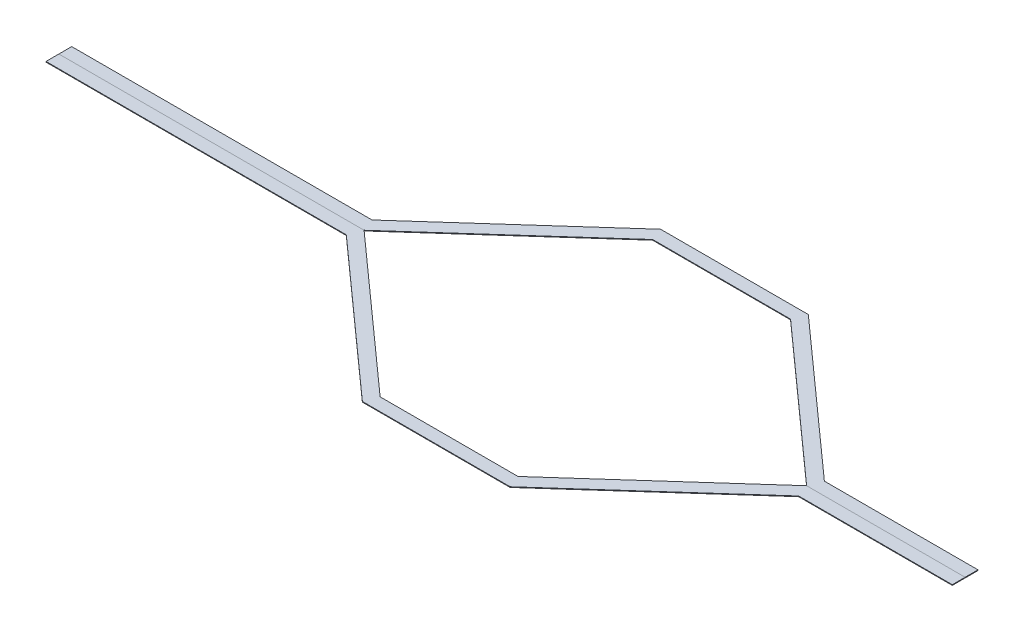
ISO-10303-21;
HEADER;
FILE_DESCRIPTION(('STEP AP214'),'2;1');
FILE_NAME('part.step','',(''),(''),'','','');
FILE_SCHEMA(('AUTOMOTIVE_DESIGN { 1 0 10303 214 1 1 1 1 }'));
ENDSEC;
DATA;
#1=APPLICATION_CONTEXT('core data for automotive mechanical design processes');
#2=APPLICATION_PROTOCOL_DEFINITION('international standard','automotive_design',2000,#1);
#3=PRODUCT_CONTEXT('',#1,'mechanical');
#4=PRODUCT('Part','Part','',(#3));
#5=PRODUCT_RELATED_PRODUCT_CATEGORY('part','',(#4));
#6=PRODUCT_DEFINITION_FORMATION('','',#4);
#7=PRODUCT_DEFINITION_CONTEXT('part definition',#1,'design');
#8=PRODUCT_DEFINITION('design','',#6,#7);
#9=PRODUCT_DEFINITION_SHAPE('','',#8);
#10=(LENGTH_UNIT() NAMED_UNIT(*) SI_UNIT(.MILLI.,.METRE.));
#11=(NAMED_UNIT(*) PLANE_ANGLE_UNIT() SI_UNIT($,.RADIAN.));
#12=(NAMED_UNIT(*) SI_UNIT($,.STERADIAN.) SOLID_ANGLE_UNIT());
#13=UNCERTAINTY_MEASURE_WITH_UNIT(LENGTH_MEASURE(1.E-05),#10,'distance_accuracy_value','');
#14=(GEOMETRIC_REPRESENTATION_CONTEXT(3) GLOBAL_UNCERTAINTY_ASSIGNED_CONTEXT((#13)) GLOBAL_UNIT_ASSIGNED_CONTEXT((#10,
#11,#12)) REPRESENTATION_CONTEXT('',''));
#15=CARTESIAN_POINT('',(0.,0.,0.));
#16=DIRECTION('',(0.,0.,1.));
#17=DIRECTION('',(1.,0.,0.));
#18=AXIS2_PLACEMENT_3D('',#15,#16,#17);
#19=CARTESIAN_POINT('',(0.,2.54,0.));
#20=DIRECTION('',(0.,1.,0.));
#21=DIRECTION('',(0.,0.,1.));
#22=AXIS2_PLACEMENT_3D('',#19,#20,#21);
#23=PLANE('',#22);
#24=DIRECTION('',(-1.,0.,0.));
#25=VECTOR('',#24,1.);
#26=CARTESIAN_POINT('',(0.,2.54,0.));
#27=LINE('',#26,#25);
#28=CARTESIAN_POINT('',(1748.8414211344,2.54,0.));
#29=VERTEX_POINT('',#28);
#30=CARTESIAN_POINT('',(2375.3067105672,2.54,0.));
#31=VERTEX_POINT('',#30);
#32=EDGE_CURVE('P0_E161',#29,#31,#27,.F.);
#33=ORIENTED_EDGE('',*,*,#32,.T.);
#34=DIRECTION('',(0.,0.,-1.));
#35=VECTOR('',#34,1.);
#36=CARTESIAN_POINT('',(2375.3067105672,2.54,0.));
#37=LINE('',#36,#35);
#38=CARTESIAN_POINT('',(2375.3067105672,2.54,-50.8));
#39=VERTEX_POINT('',#38);
#40=EDGE_CURVE('P0_E163',#39,#31,#37,.F.);
#41=ORIENTED_EDGE('',*,*,#40,.F.);
#42=DIRECTION('',(-1.,0.,0.));
#43=VECTOR('',#42,1.);
#44=CARTESIAN_POINT('',(0.,2.54,-50.8));
#45=LINE('',#44,#43);
#46=CARTESIAN_POINT('',(1768.2467105672,2.54,-50.8000000000003));
#47=VERTEX_POINT('',#46);
#48=EDGE_CURVE('P0_E118',#47,#39,#45,.F.);
#49=ORIENTED_EDGE('',*,*,#48,.F.);
#50=DIRECTION('',(-0.745323557128352,0.,-0.666702928739285));
#51=VECTOR('',#50,1.);
#52=CARTESIAN_POINT('',(811.215920403235,2.54,-906.878175167768));
#53=LINE('',#52,#51);
#54=CARTESIAN_POINT('',(1166.2667105672,2.54,-589.28));
#55=VERTEX_POINT('',#54);
#56=EDGE_CURVE('P0_E19',#55,#47,#53,.F.);
#57=ORIENTED_EDGE('',*,*,#56,.F.);
#58=DIRECTION('',(-1.,0.,0.));
#59=VECTOR('',#58,1.);
#60=CARTESIAN_POINT('',(0.,2.54,-589.28));
#61=LINE('',#60,#59);
#62=CARTESIAN_POINT('',(582.574710567202,2.54,-589.28));
#63=VERTEX_POINT('',#62);
#64=EDGE_CURVE('P0_E106',#63,#55,#61,.F.);
#65=ORIENTED_EDGE('',*,*,#64,.F.);
#66=DIRECTION('',(-0.745323557128352,0.,0.666702928739285));
#67=VECTOR('',#66,1.);
#68=CARTESIAN_POINT('',(-33.8685087799557,2.54,-37.8624367021203));
#69=LINE('',#68,#67);
#70=CARTESIAN_POINT('',(-19.4052894327977,2.54,-50.8));
#71=VERTEX_POINT('',#70);
#72=EDGE_CURVE('P0_E101',#71,#63,#69,.F.);
#73=ORIENTED_EDGE('',*,*,#72,.F.);
#74=DIRECTION('',(-1.,0.,0.));
#75=VECTOR('',#74,1.);
#76=CARTESIAN_POINT('',(0.,2.54,-50.8));
#77=LINE('',#76,#75);
#78=CARTESIAN_POINT('',(-1206.0932894328,2.54,-50.8));
#79=VERTEX_POINT('',#78);
#80=EDGE_CURVE('P0_E129',#79,#71,#77,.F.);
#81=ORIENTED_EDGE('',*,*,#80,.F.);
#82=DIRECTION('',(0.,0.,-1.));
#83=VECTOR('',#82,1.);
#84=CARTESIAN_POINT('',(-1206.0932894328,2.54,0.));
#85=LINE('',#84,#83);
#86=CARTESIAN_POINT('',(-1206.0932894328,2.54,0.));
#87=VERTEX_POINT('',#86);
#88=EDGE_CURVE('P0_E136',#79,#87,#85,.F.);
#89=ORIENTED_EDGE('',*,*,#88,.T.);
#90=DIRECTION('',(-1.,0.,0.));
#91=VECTOR('',#90,1.);
#92=CARTESIAN_POINT('',(0.,2.54,0.));
#93=LINE('',#92,#91);
#94=CARTESIAN_POINT('',(0.,2.54,0.));
#95=VERTEX_POINT('',#94);
#96=EDGE_CURVE('P0_E141',#87,#95,#93,.F.);
#97=ORIENTED_EDGE('',*,*,#96,.T.);
#98=DIRECTION('',(-0.745323557128352,0.,0.666702928739285));
#99=VECTOR('',#98,1.);
#100=CARTESIAN_POINT('',(0.,2.54,0.));
#101=LINE('',#100,#99);
#102=CARTESIAN_POINT('',(601.98,2.54,-538.48));
#103=VERTEX_POINT('',#102);
#104=EDGE_CURVE('P0_E146',#95,#103,#101,.F.);
#105=ORIENTED_EDGE('',*,*,#104,.T.);
#106=DIRECTION('',(-1.,0.,0.));
#107=VECTOR('',#106,1.);
#108=CARTESIAN_POINT('',(0.,2.54,-538.48));
#109=LINE('',#108,#107);
#110=CARTESIAN_POINT('',(1146.8614211344,2.54,-538.48));
#111=VERTEX_POINT('',#110);
#112=EDGE_CURVE('P0_E151',#103,#111,#109,.F.);
#113=ORIENTED_EDGE('',*,*,#112,.T.);
#114=DIRECTION('',(-0.745323557128352,0.,-0.666702928739285));
#115=VECTOR('',#114,1.);
#116=CARTESIAN_POINT('',(777.34741162328,2.54,-869.015738465647));
#117=LINE('',#116,#115);
#118=EDGE_CURVE('P0_E156',#111,#29,#117,.F.);
#119=ORIENTED_EDGE('',*,*,#118,.T.);
#120=EDGE_LOOP('',(#33,#41,#49,#57,#65,#73,#81,#89,#97,#105,#113,#119));
#121=FACE_BOUND('',#120,.T.);
#122=ADVANCED_FACE('P0_F16',(#121),#23,.T.);
#123=CARTESIAN_POINT('',(811.215920403235,2.54,-906.878175167768));
#124=DIRECTION('',(0.666702928739285,0.,-0.745323557128352));
#125=DIRECTION('',(-0.745323557128352,0.,-0.666702928739285));
#126=AXIS2_PLACEMENT_3D('',#123,#124,#125);
#127=PLANE('',#126);
#128=ORIENTED_EDGE('',*,*,#56,.T.);
#129=DIRECTION('',(0.,1.,0.));
#130=VECTOR('',#129,1.);
#131=CARTESIAN_POINT('',(1768.2467105672,2.54,-50.8));
#132=LINE('',#131,#130);
#133=CARTESIAN_POINT('',(1768.2467105672,0.,-50.8000000000003));
#134=VERTEX_POINT('',#133);
#135=EDGE_CURVE('P0_E167',#134,#47,#132,.T.);
#136=ORIENTED_EDGE('',*,*,#135,.F.);
#137=DIRECTION('',(-0.745323557128352,0.,-0.666702928739285));
#138=VECTOR('',#137,1.);
#139=CARTESIAN_POINT('',(1768.2467105672,0.,-50.8000000000004));
#140=LINE('',#139,#138);
#141=CARTESIAN_POINT('',(1166.2667105672,0.,-589.28));
#142=VERTEX_POINT('',#141);
#143=EDGE_CURVE('P0_E124',#134,#142,#140,.T.);
#144=ORIENTED_EDGE('',*,*,#143,.T.);
#145=DIRECTION('',(0.,1.,0.));
#146=VECTOR('',#145,1.);
#147=CARTESIAN_POINT('',(1166.2667105672,2.54,-589.28));
#148=LINE('',#147,#146);
#149=EDGE_CURVE('P0_E111',#55,#142,#148,.F.);
#150=ORIENTED_EDGE('',*,*,#149,.F.);
#151=EDGE_LOOP('',(#128,#136,#144,#150));
#152=FACE_BOUND('',#151,.T.);
#153=ADVANCED_FACE('P0_F123',(#152),#127,.T.);
#154=CARTESIAN_POINT('',(0.,2.54,-589.28));
#155=DIRECTION('',(0.,0.,-1.));
#156=DIRECTION('',(-1.,0.,0.));
#157=AXIS2_PLACEMENT_3D('',#154,#155,#156);
#158=PLANE('',#157);
#159=ORIENTED_EDGE('',*,*,#64,.T.);
#160=ORIENTED_EDGE('',*,*,#149,.T.);
#161=DIRECTION('',(1.,0.,0.));
#162=VECTOR('',#161,1.);
#163=CARTESIAN_POINT('',(0.,0.,-589.28));
#164=LINE('',#163,#162);
#165=CARTESIAN_POINT('',(582.574710567202,0.,-589.28));
#166=VERTEX_POINT('',#165);
#167=EDGE_CURVE('P0_E172',#142,#166,#164,.F.);
#168=ORIENTED_EDGE('',*,*,#167,.T.);
#169=DIRECTION('',(0.,1.,0.));
#170=VECTOR('',#169,1.);
#171=CARTESIAN_POINT('',(582.574710567202,2.54,-589.28));
#172=LINE('',#171,#170);
#173=EDGE_CURVE('P0_E113',#63,#166,#172,.F.);
#174=ORIENTED_EDGE('',*,*,#173,.F.);
#175=EDGE_LOOP('',(#159,#160,#168,#174));
#176=FACE_BOUND('',#175,.T.);
#177=ADVANCED_FACE('P0_F108',(#176),#158,.T.);
#178=CARTESIAN_POINT('',(-33.8685087799557,2.54,-37.8624367021203));
#179=DIRECTION('',(-0.666702928739285,0.,-0.745323557128352));
#180=DIRECTION('',(-0.745323557128352,0.,0.666702928739285));
#181=AXIS2_PLACEMENT_3D('',#178,#179,#180);
#182=PLANE('',#181);
#183=ORIENTED_EDGE('',*,*,#72,.T.);
#184=ORIENTED_EDGE('',*,*,#173,.T.);
#185=DIRECTION('',(-0.745323557128352,0.,0.666702928739285));
#186=VECTOR('',#185,1.);
#187=CARTESIAN_POINT('',(582.574710567202,0.,-589.28));
#188=LINE('',#187,#186);
#189=CARTESIAN_POINT('',(-19.4052894327978,0.,-50.8));
#190=VERTEX_POINT('',#189);
#191=EDGE_CURVE('P0_E174',#166,#190,#188,.T.);
#192=ORIENTED_EDGE('',*,*,#191,.T.);
#193=DIRECTION('',(0.,1.,0.));
#194=VECTOR('',#193,1.);
#195=CARTESIAN_POINT('',(-19.4052894327978,2.54,-50.8));
#196=LINE('',#195,#194);
#197=EDGE_CURVE('P0_E131',#71,#190,#196,.F.);
#198=ORIENTED_EDGE('',*,*,#197,.F.);
#199=EDGE_LOOP('',(#183,#184,#192,#198));
#200=FACE_BOUND('',#199,.T.);
#201=ADVANCED_FACE('P0_F233',(#200),#182,.T.);
#202=CARTESIAN_POINT('',(0.,2.54,-50.8));
#203=DIRECTION('',(0.,0.,-1.));
#204=DIRECTION('',(-1.,0.,0.));
#205=AXIS2_PLACEMENT_3D('',#202,#203,#204);
#206=PLANE('',#205);
#207=ORIENTED_EDGE('',*,*,#80,.T.);
#208=ORIENTED_EDGE('',*,*,#197,.T.);
#209=DIRECTION('',(1.,0.,0.));
#210=VECTOR('',#209,1.);
#211=CARTESIAN_POINT('',(0.,0.,-50.8));
#212=LINE('',#211,#210);
#213=CARTESIAN_POINT('',(-1206.0932894328,0.,-50.8));
#214=VERTEX_POINT('',#213);
#215=EDGE_CURVE('P0_E177',#190,#214,#212,.F.);
#216=ORIENTED_EDGE('',*,*,#215,.T.);
#217=DIRECTION('',(0.,1.,0.));
#218=VECTOR('',#217,1.);
#219=CARTESIAN_POINT('',(-1206.0932894328,2.54,-50.8));
#220=LINE('',#219,#218);
#221=EDGE_CURVE('P0_E133',#214,#79,#220,.T.);
#222=ORIENTED_EDGE('',*,*,#221,.T.);
#223=EDGE_LOOP('',(#207,#208,#216,#222));
#224=FACE_BOUND('',#223,.T.);
#225=ADVANCED_FACE('P0_F232',(#224),#206,.T.);
#226=CARTESIAN_POINT('',(-1206.0932894328,2.54,0.));
#227=DIRECTION('',(1.,0.,0.));
#228=DIRECTION('',(0.,0.,-1.));
#229=AXIS2_PLACEMENT_3D('',#226,#227,#228);
#230=PLANE('',#229);
#231=DIRECTION('',(0.,1.,0.));
#232=VECTOR('',#231,1.);
#233=CARTESIAN_POINT('',(-1206.0932894328,2.54,0.));
#234=LINE('',#233,#232);
#235=CARTESIAN_POINT('',(-1206.0932894328,0.,0.));
#236=VERTEX_POINT('',#235);
#237=EDGE_CURVE('P0_E138',#236,#87,#234,.T.);
#238=ORIENTED_EDGE('',*,*,#237,.T.);
#239=ORIENTED_EDGE('',*,*,#88,.F.);
#240=ORIENTED_EDGE('',*,*,#221,.F.);
#241=DIRECTION('',(0.,0.,1.));
#242=VECTOR('',#241,1.);
#243=CARTESIAN_POINT('',(-1206.0932894328,0.,0.));
#244=LINE('',#243,#242);
#245=EDGE_CURVE('P0_E180',#214,#236,#244,.T.);
#246=ORIENTED_EDGE('',*,*,#245,.T.);
#247=EDGE_LOOP('',(#238,#239,#240,#246));
#248=FACE_BOUND('',#247,.T.);
#249=ADVANCED_FACE('P0_F228',(#248),#230,.F.);
#250=CARTESIAN_POINT('',(0.,2.54,0.));
#251=DIRECTION('',(0.,0.,-1.));
#252=DIRECTION('',(-1.,0.,0.));
#253=AXIS2_PLACEMENT_3D('',#250,#251,#252);
#254=PLANE('',#253);
#255=DIRECTION('',(0.,1.,0.));
#256=VECTOR('',#255,1.);
#257=CARTESIAN_POINT('',(0.,2.54,0.));
#258=LINE('',#257,#256);
#259=CARTESIAN_POINT('',(0.,0.,0.));
#260=VERTEX_POINT('',#259);
#261=EDGE_CURVE('P0_E143',#260,#95,#258,.T.);
#262=ORIENTED_EDGE('',*,*,#261,.T.);
#263=ORIENTED_EDGE('',*,*,#96,.F.);
#264=ORIENTED_EDGE('',*,*,#237,.F.);
#265=DIRECTION('',(1.,0.,0.));
#266=VECTOR('',#265,1.);
#267=CARTESIAN_POINT('',(0.,0.,0.));
#268=LINE('',#267,#266);
#269=EDGE_CURVE('P0_E183',#236,#260,#268,.T.);
#270=ORIENTED_EDGE('',*,*,#269,.T.);
#271=EDGE_LOOP('',(#262,#263,#264,#270));
#272=FACE_BOUND('',#271,.T.);
#273=ADVANCED_FACE('P0_F224',(#272),#254,.F.);
#274=CARTESIAN_POINT('',(0.,2.54,0.));
#275=DIRECTION('',(-0.666702928739285,0.,-0.745323557128352));
#276=DIRECTION('',(-0.745323557128352,0.,0.666702928739285));
#277=AXIS2_PLACEMENT_3D('',#274,#275,#276);
#278=PLANE('',#277);
#279=DIRECTION('',(0.,1.,0.));
#280=VECTOR('',#279,1.);
#281=CARTESIAN_POINT('',(601.98,2.54,-538.48));
#282=LINE('',#281,#280);
#283=CARTESIAN_POINT('',(601.98,0.,-538.48));
#284=VERTEX_POINT('',#283);
#285=EDGE_CURVE('P0_E148',#284,#103,#282,.T.);
#286=ORIENTED_EDGE('',*,*,#285,.T.);
#287=ORIENTED_EDGE('',*,*,#104,.F.);
#288=ORIENTED_EDGE('',*,*,#261,.F.);
#289=DIRECTION('',(0.745323557128352,0.,-0.666702928739285));
#290=VECTOR('',#289,1.);
#291=CARTESIAN_POINT('',(0.,0.,0.));
#292=LINE('',#291,#290);
#293=EDGE_CURVE('P0_E186',#260,#284,#292,.T.);
#294=ORIENTED_EDGE('',*,*,#293,.T.);
#295=EDGE_LOOP('',(#286,#287,#288,#294));
#296=FACE_BOUND('',#295,.T.);
#297=ADVANCED_FACE('P0_F220',(#296),#278,.F.);
#298=CARTESIAN_POINT('',(0.,2.54,-538.48));
#299=DIRECTION('',(0.,0.,-1.));
#300=DIRECTION('',(-1.,0.,0.));
#301=AXIS2_PLACEMENT_3D('',#298,#299,#300);
#302=PLANE('',#301);
#303=DIRECTION('',(0.,1.,0.));
#304=VECTOR('',#303,1.);
#305=CARTESIAN_POINT('',(1146.8614211344,2.54,-538.48));
#306=LINE('',#305,#304);
#307=CARTESIAN_POINT('',(1146.8614211344,0.,-538.48));
#308=VERTEX_POINT('',#307);
#309=EDGE_CURVE('P0_E153',#308,#111,#306,.T.);
#310=ORIENTED_EDGE('',*,*,#309,.T.);
#311=ORIENTED_EDGE('',*,*,#112,.F.);
#312=ORIENTED_EDGE('',*,*,#285,.F.);
#313=DIRECTION('',(1.,0.,0.));
#314=VECTOR('',#313,1.);
#315=CARTESIAN_POINT('',(0.,0.,-538.48));
#316=LINE('',#315,#314);
#317=EDGE_CURVE('P0_E189',#284,#308,#316,.T.);
#318=ORIENTED_EDGE('',*,*,#317,.T.);
#319=EDGE_LOOP('',(#310,#311,#312,#318));
#320=FACE_BOUND('',#319,.T.);
#321=ADVANCED_FACE('P0_F216',(#320),#302,.F.);
#322=CARTESIAN_POINT('',(777.34741162328,2.54,-869.015738465647));
#323=DIRECTION('',(0.666702928739285,0.,-0.745323557128352));
#324=DIRECTION('',(-0.745323557128352,0.,-0.666702928739285));
#325=AXIS2_PLACEMENT_3D('',#322,#323,#324);
#326=PLANE('',#325);
#327=DIRECTION('',(0.,1.,0.));
#328=VECTOR('',#327,1.);
#329=CARTESIAN_POINT('',(1748.8414211344,2.54,0.));
#330=LINE('',#329,#328);
#331=CARTESIAN_POINT('',(1748.8414211344,0.,1.94289029309402E-13));
#332=VERTEX_POINT('',#331);
#333=EDGE_CURVE('P0_E158',#332,#29,#330,.T.);
#334=ORIENTED_EDGE('',*,*,#333,.T.);
#335=ORIENTED_EDGE('',*,*,#118,.F.);
#336=ORIENTED_EDGE('',*,*,#309,.F.);
#337=DIRECTION('',(0.745323557128352,0.,0.666702928739285));
#338=VECTOR('',#337,1.);
#339=CARTESIAN_POINT('',(1146.8614211344,0.,-538.48));
#340=LINE('',#339,#338);
#341=EDGE_CURVE('P0_E192',#308,#332,#340,.T.);
#342=ORIENTED_EDGE('',*,*,#341,.T.);
#343=EDGE_LOOP('',(#334,#335,#336,#342));
#344=FACE_BOUND('',#343,.T.);
#345=ADVANCED_FACE('P0_F212',(#344),#326,.F.);
#346=CARTESIAN_POINT('',(0.,2.54,0.));
#347=DIRECTION('',(0.,0.,-1.));
#348=DIRECTION('',(-1.,0.,0.));
#349=AXIS2_PLACEMENT_3D('',#346,#347,#348);
#350=PLANE('',#349);
#351=DIRECTION('',(0.,1.,0.));
#352=VECTOR('',#351,1.);
#353=CARTESIAN_POINT('',(2375.3067105672,2.54,0.));
#354=LINE('',#353,#352);
#355=CARTESIAN_POINT('',(2375.3067105672,0.,0.));
#356=VERTEX_POINT('',#355);
#357=EDGE_CURVE('P0_E165',#31,#356,#354,.F.);
#358=ORIENTED_EDGE('',*,*,#357,.F.);
#359=ORIENTED_EDGE('',*,*,#32,.F.);
#360=ORIENTED_EDGE('',*,*,#333,.F.);
#361=DIRECTION('',(1.,0.,0.));
#362=VECTOR('',#361,1.);
#363=CARTESIAN_POINT('',(0.,0.,0.));
#364=LINE('',#363,#362);
#365=EDGE_CURVE('P0_E195',#332,#356,#364,.T.);
#366=ORIENTED_EDGE('',*,*,#365,.T.);
#367=EDGE_LOOP('',(#358,#359,#360,#366));
#368=FACE_BOUND('',#367,.T.);
#369=ADVANCED_FACE('P0_F208',(#368),#350,.F.);
#370=CARTESIAN_POINT('',(2375.3067105672,2.54,0.));
#371=DIRECTION('',(1.,0.,0.));
#372=DIRECTION('',(0.,0.,-1.));
#373=AXIS2_PLACEMENT_3D('',#370,#371,#372);
#374=PLANE('',#373);
#375=ORIENTED_EDGE('',*,*,#40,.T.);
#376=ORIENTED_EDGE('',*,*,#357,.T.);
#377=DIRECTION('',(0.,0.,1.));
#378=VECTOR('',#377,1.);
#379=CARTESIAN_POINT('',(2375.3067105672,0.,0.));
#380=LINE('',#379,#378);
#381=CARTESIAN_POINT('',(2375.3067105672,0.,-50.8));
#382=VERTEX_POINT('',#381);
#383=EDGE_CURVE('P0_E25',#356,#382,#380,.F.);
#384=ORIENTED_EDGE('',*,*,#383,.T.);
#385=DIRECTION('',(0.,1.,0.));
#386=VECTOR('',#385,1.);
#387=CARTESIAN_POINT('',(2375.3067105672,2.54,-50.8));
#388=LINE('',#387,#386);
#389=EDGE_CURVE('P0_E33',#39,#382,#388,.F.);
#390=ORIENTED_EDGE('',*,*,#389,.F.);
#391=EDGE_LOOP('',(#375,#376,#384,#390));
#392=FACE_BOUND('',#391,.T.);
#393=ADVANCED_FACE('P0_F201',(#392),#374,.T.);
#394=CARTESIAN_POINT('',(0.,2.54,-50.8));
#395=DIRECTION('',(0.,0.,-1.));
#396=DIRECTION('',(-1.,0.,0.));
#397=AXIS2_PLACEMENT_3D('',#394,#395,#396);
#398=PLANE('',#397);
#399=ORIENTED_EDGE('',*,*,#48,.T.);
#400=ORIENTED_EDGE('',*,*,#389,.T.);
#401=DIRECTION('',(1.,0.,0.));
#402=VECTOR('',#401,1.);
#403=CARTESIAN_POINT('',(0.,0.,-50.8));
#404=LINE('',#403,#402);
#405=EDGE_CURVE('P0_E11',#382,#134,#404,.F.);
#406=ORIENTED_EDGE('',*,*,#405,.T.);
#407=ORIENTED_EDGE('',*,*,#135,.T.);
#408=EDGE_LOOP('',(#399,#400,#406,#407));
#409=FACE_BOUND('',#408,.T.);
#410=ADVANCED_FACE('P0_F234',(#409),#398,.T.);
#411=CARTESIAN_POINT('',(0.,0.,0.));
#412=DIRECTION('',(0.,1.,0.));
#413=DIRECTION('',(0.,0.,1.));
#414=AXIS2_PLACEMENT_3D('',#411,#412,#413);
#415=PLANE('',#414);
#416=ORIENTED_EDGE('',*,*,#383,.F.);
#417=ORIENTED_EDGE('',*,*,#365,.F.);
#418=ORIENTED_EDGE('',*,*,#341,.F.);
#419=ORIENTED_EDGE('',*,*,#317,.F.);
#420=ORIENTED_EDGE('',*,*,#293,.F.);
#421=ORIENTED_EDGE('',*,*,#269,.F.);
#422=ORIENTED_EDGE('',*,*,#245,.F.);
#423=ORIENTED_EDGE('',*,*,#215,.F.);
#424=ORIENTED_EDGE('',*,*,#191,.F.);
#425=ORIENTED_EDGE('',*,*,#167,.F.);
#426=ORIENTED_EDGE('',*,*,#143,.F.);
#427=ORIENTED_EDGE('',*,*,#405,.F.);
#428=EDGE_LOOP('',(#416,#417,#418,#419,#420,#421,#422,#423,#424,#425,#426,#427));
#429=FACE_BOUND('',#428,.T.);
#430=ADVANCED_FACE('P0_F205',(#429),#415,.F.);
#431=CLOSED_SHELL('',(#122,#153,#177,#201,#225,#249,#273,#297,#321,#345,#369,#393,#410,#430));
#432=MANIFOLD_SOLID_BREP('P0_B1',#431);
#433=CARTESIAN_POINT('',(0.,2.54,0.));
#434=DIRECTION('',(0.,1.,0.));
#435=DIRECTION('',(0.,0.,1.));
#436=AXIS2_PLACEMENT_3D('',#433,#434,#435);
#437=PLANE('',#436);
#438=DIRECTION('',(-1.,0.,0.));
#439=VECTOR('',#438,1.);
#440=CARTESIAN_POINT('',(0.,2.54,0.));
#441=LINE('',#440,#439);
#442=CARTESIAN_POINT('',(-1206.0932894328,2.54,0.));
#443=VERTEX_POINT('',#442);
#444=CARTESIAN_POINT('',(0.,2.54,0.));
#445=VERTEX_POINT('',#444);
#446=EDGE_CURVE('P1_E156',#443,#445,#441,.F.);
#447=ORIENTED_EDGE('',*,*,#446,.F.);
#448=DIRECTION('',(0.,0.,-1.));
#449=VECTOR('',#448,1.);
#450=CARTESIAN_POINT('',(-1206.0932894328,2.54,0.));
#451=LINE('',#450,#449);
#452=CARTESIAN_POINT('',(-1206.0932894328,2.54,50.8));
#453=VERTEX_POINT('',#452);
#454=EDGE_CURVE('P1_E163',#443,#453,#451,.F.);
#455=ORIENTED_EDGE('',*,*,#454,.T.);
#456=DIRECTION('',(1.,0.,0.));
#457=VECTOR('',#456,1.);
#458=CARTESIAN_POINT('',(0.,2.54,50.7999999999999));
#459=LINE('',#458,#457);
#460=CARTESIAN_POINT('',(-19.4052894327977,2.54,50.7999999999999));
#461=VERTEX_POINT('',#460);
#462=EDGE_CURVE('P1_E117',#461,#453,#459,.F.);
#463=ORIENTED_EDGE('',*,*,#462,.F.);
#464=DIRECTION('',(0.745323557128352,0.,0.666702928739285));
#465=VECTOR('',#464,1.);
#466=CARTESIAN_POINT('',(-33.8685087799556,2.54,37.8624367021202));
#467=LINE('',#466,#465);
#468=CARTESIAN_POINT('',(582.574710567202,2.54,589.28));
#469=VERTEX_POINT('',#468);
#470=EDGE_CURVE('P1_E19',#469,#461,#467,.F.);
#471=ORIENTED_EDGE('',*,*,#470,.F.);
#472=DIRECTION('',(1.,0.,0.));
#473=VECTOR('',#472,1.);
#474=CARTESIAN_POINT('',(1.12085179161461E-13,2.54,589.28));
#475=LINE('',#474,#473);
#476=CARTESIAN_POINT('',(1166.2667105672,2.54,589.28));
#477=VERTEX_POINT('',#476);
#478=EDGE_CURVE('P1_E106',#477,#469,#475,.F.);
#479=ORIENTED_EDGE('',*,*,#478,.F.);
#480=DIRECTION('',(0.745323557128352,0.,-0.666702928739285));
#481=VECTOR('',#480,1.);
#482=CARTESIAN_POINT('',(811.215920403235,2.54,906.878175167768));
#483=LINE('',#482,#481);
#484=CARTESIAN_POINT('',(1768.2467105672,2.54,50.8000000000001));
#485=VERTEX_POINT('',#484);
#486=EDGE_CURVE('P1_E101',#485,#477,#483,.F.);
#487=ORIENTED_EDGE('',*,*,#486,.F.);
#488=DIRECTION('',(1.,0.,0.));
#489=VECTOR('',#488,1.);
#490=CARTESIAN_POINT('',(0.,2.54,50.8000000000003));
#491=LINE('',#490,#489);
#492=CARTESIAN_POINT('',(2375.3067105672,2.54,50.8));
#493=VERTEX_POINT('',#492);
#494=EDGE_CURVE('P1_E128',#493,#485,#491,.F.);
#495=ORIENTED_EDGE('',*,*,#494,.F.);
#496=DIRECTION('',(0.,0.,-1.));
#497=VECTOR('',#496,1.);
#498=CARTESIAN_POINT('',(2375.3067105672,2.54,0.));
#499=LINE('',#498,#497);
#500=CARTESIAN_POINT('',(2375.3067105672,2.54,0.));
#501=VERTEX_POINT('',#500);
#502=EDGE_CURVE('P1_E132',#501,#493,#499,.F.);
#503=ORIENTED_EDGE('',*,*,#502,.F.);
#504=DIRECTION('',(-1.,0.,0.));
#505=VECTOR('',#504,1.);
#506=CARTESIAN_POINT('',(0.,2.54,0.));
#507=LINE('',#506,#505);
#508=CARTESIAN_POINT('',(1748.8414211344,2.54,-1.10593395329907E-13));
#509=VERTEX_POINT('',#508);
#510=EDGE_CURVE('P1_E136',#509,#501,#507,.F.);
#511=ORIENTED_EDGE('',*,*,#510,.F.);
#512=DIRECTION('',(0.745323557128352,0.,-0.666702928739286));
#513=VECTOR('',#512,1.);
#514=CARTESIAN_POINT('',(777.34741162328,2.54,869.015738465648));
#515=LINE('',#514,#513);
#516=CARTESIAN_POINT('',(1146.8614211344,2.54,538.48));
#517=VERTEX_POINT('',#516);
#518=EDGE_CURVE('P1_E143',#509,#517,#515,.F.);
#519=ORIENTED_EDGE('',*,*,#518,.T.);
#520=DIRECTION('',(1.,0.,0.));
#521=VECTOR('',#520,1.);
#522=CARTESIAN_POINT('',(1.09717981034389E-13,2.54,538.48));
#523=LINE('',#522,#521);
#524=CARTESIAN_POINT('',(601.98,2.54,538.48));
#525=VERTEX_POINT('',#524);
#526=EDGE_CURVE('P1_E148',#517,#525,#523,.F.);
#527=ORIENTED_EDGE('',*,*,#526,.T.);
#528=DIRECTION('',(0.745323557128352,0.,0.666702928739285));
#529=VECTOR('',#528,1.);
#530=CARTESIAN_POINT('',(0.,2.54,0.));
#531=LINE('',#530,#529);
#532=EDGE_CURVE('P1_E153',#525,#445,#531,.F.);
#533=ORIENTED_EDGE('',*,*,#532,.T.);
#534=EDGE_LOOP('',(#447,#455,#463,#471,#479,#487,#495,#503,#511,#519,#527,#533));
#535=FACE_BOUND('',#534,.T.);
#536=ADVANCED_FACE('P1_F16',(#535),#437,.T.);
#537=CARTESIAN_POINT('',(-33.8685087799556,2.54,37.8624367021202));
#538=DIRECTION('',(-0.666702928739285,0.,0.745323557128352));
#539=DIRECTION('',(0.745323557128352,0.,0.666702928739285));
#540=AXIS2_PLACEMENT_3D('',#537,#538,#539);
#541=PLANE('',#540);
#542=ORIENTED_EDGE('',*,*,#470,.T.);
#543=DIRECTION('',(0.,1.,0.));
#544=VECTOR('',#543,1.);
#545=CARTESIAN_POINT('',(-19.4052894327978,2.54,50.7999999999999));
#546=LINE('',#545,#544);
#547=CARTESIAN_POINT('',(-19.4052894327977,0.,50.7999999999999));
#548=VERTEX_POINT('',#547);
#549=EDGE_CURVE('P1_E165',#548,#461,#546,.T.);
#550=ORIENTED_EDGE('',*,*,#549,.F.);
#551=DIRECTION('',(0.745323557128352,0.,0.666702928739285));
#552=VECTOR('',#551,1.);
#553=CARTESIAN_POINT('',(-19.4052894327978,0.,50.7999999999998));
#554=LINE('',#553,#552);
#555=CARTESIAN_POINT('',(582.574710567202,0.,589.28));
#556=VERTEX_POINT('',#555);
#557=EDGE_CURVE('P1_E123',#548,#556,#554,.T.);
#558=ORIENTED_EDGE('',*,*,#557,.T.);
#559=DIRECTION('',(0.,1.,0.));
#560=VECTOR('',#559,1.);
#561=CARTESIAN_POINT('',(582.574710567202,2.54,589.28));
#562=LINE('',#561,#560);
#563=EDGE_CURVE('P1_E111',#469,#556,#562,.F.);
#564=ORIENTED_EDGE('',*,*,#563,.F.);
#565=EDGE_LOOP('',(#542,#550,#558,#564));
#566=FACE_BOUND('',#565,.T.);
#567=ADVANCED_FACE('P1_F122',(#566),#541,.T.);
#568=CARTESIAN_POINT('',(1.12085179161461E-13,2.54,589.28));
#569=DIRECTION('',(0.,0.,1.));
#570=DIRECTION('',(1.,0.,0.));
#571=AXIS2_PLACEMENT_3D('',#568,#569,#570);
#572=PLANE('',#571);
#573=ORIENTED_EDGE('',*,*,#478,.T.);
#574=ORIENTED_EDGE('',*,*,#563,.T.);
#575=DIRECTION('',(1.,0.,0.));
#576=VECTOR('',#575,1.);
#577=CARTESIAN_POINT('',(0.,0.,589.28));
#578=LINE('',#577,#576);
#579=CARTESIAN_POINT('',(1166.2667105672,0.,589.28));
#580=VERTEX_POINT('',#579);
#581=EDGE_CURVE('P1_E170',#556,#580,#578,.T.);
#582=ORIENTED_EDGE('',*,*,#581,.T.);
#583=DIRECTION('',(0.,1.,0.));
#584=VECTOR('',#583,1.);
#585=CARTESIAN_POINT('',(1166.2667105672,2.54,589.28));
#586=LINE('',#585,#584);
#587=EDGE_CURVE('P1_E113',#477,#580,#586,.F.);
#588=ORIENTED_EDGE('',*,*,#587,.F.);
#589=EDGE_LOOP('',(#573,#574,#582,#588));
#590=FACE_BOUND('',#589,.T.);
#591=ADVANCED_FACE('P1_F108',(#590),#572,.T.);
#592=CARTESIAN_POINT('',(811.215920403235,2.54,906.878175167768));
#593=DIRECTION('',(0.666702928739285,0.,0.745323557128352));
#594=DIRECTION('',(0.745323557128352,0.,-0.666702928739285));
#595=AXIS2_PLACEMENT_3D('',#592,#593,#594);
#596=PLANE('',#595);
#597=ORIENTED_EDGE('',*,*,#486,.T.);
#598=ORIENTED_EDGE('',*,*,#587,.T.);
#599=DIRECTION('',(0.745323557128352,0.,-0.666702928739285));
#600=VECTOR('',#599,1.);
#601=CARTESIAN_POINT('',(1166.2667105672,0.,589.28));
#602=LINE('',#601,#600);
#603=CARTESIAN_POINT('',(1768.2467105672,0.,50.8000000000001));
#604=VERTEX_POINT('',#603);
#605=EDGE_CURVE('P1_E172',#580,#604,#602,.T.);
#606=ORIENTED_EDGE('',*,*,#605,.T.);
#607=DIRECTION('',(0.,1.,0.));
#608=VECTOR('',#607,1.);
#609=CARTESIAN_POINT('',(1768.2467105672,2.54,50.8000000000001));
#610=LINE('',#609,#608);
#611=EDGE_CURVE('P1_E130',#485,#604,#610,.F.);
#612=ORIENTED_EDGE('',*,*,#611,.F.);
#613=EDGE_LOOP('',(#597,#598,#606,#612));
#614=FACE_BOUND('',#613,.T.);
#615=ADVANCED_FACE('P1_F233',(#614),#596,.T.);
#616=CARTESIAN_POINT('',(0.,2.54,50.8000000000003));
#617=DIRECTION('',(0.,0.,1.));
#618=DIRECTION('',(1.,0.,0.));
#619=AXIS2_PLACEMENT_3D('',#616,#617,#618);
#620=PLANE('',#619);
#621=ORIENTED_EDGE('',*,*,#494,.T.);
#622=ORIENTED_EDGE('',*,*,#611,.T.);
#623=DIRECTION('',(1.,0.,0.));
#624=VECTOR('',#623,1.);
#625=CARTESIAN_POINT('',(0.,0.,50.8000000000001));
#626=LINE('',#625,#624);
#627=CARTESIAN_POINT('',(2375.3067105672,0.,50.8));
#628=VERTEX_POINT('',#627);
#629=EDGE_CURVE('P1_E175',#604,#628,#626,.T.);
#630=ORIENTED_EDGE('',*,*,#629,.T.);
#631=DIRECTION('',(0.,1.,0.));
#632=VECTOR('',#631,1.);
#633=CARTESIAN_POINT('',(2375.3067105672,2.54,50.8));
#634=LINE('',#633,#632);
#635=EDGE_CURVE('P1_E134',#493,#628,#634,.F.);
#636=ORIENTED_EDGE('',*,*,#635,.F.);
#637=EDGE_LOOP('',(#621,#622,#630,#636));
#638=FACE_BOUND('',#637,.T.);
#639=ADVANCED_FACE('P1_F232',(#638),#620,.T.);
#640=CARTESIAN_POINT('',(2375.3067105672,2.54,0.));
#641=DIRECTION('',(1.,0.,0.));
#642=DIRECTION('',(0.,0.,-1.));
#643=AXIS2_PLACEMENT_3D('',#640,#641,#642);
#644=PLANE('',#643);
#645=ORIENTED_EDGE('',*,*,#502,.T.);
#646=ORIENTED_EDGE('',*,*,#635,.T.);
#647=DIRECTION('',(0.,0.,1.));
#648=VECTOR('',#647,1.);
#649=CARTESIAN_POINT('',(2375.3067105672,0.,0.));
#650=LINE('',#649,#648);
#651=CARTESIAN_POINT('',(2375.3067105672,0.,0.));
#652=VERTEX_POINT('',#651);
#653=EDGE_CURVE('P1_E178',#628,#652,#650,.F.);
#654=ORIENTED_EDGE('',*,*,#653,.T.);
#655=DIRECTION('',(0.,1.,0.));
#656=VECTOR('',#655,1.);
#657=CARTESIAN_POINT('',(2375.3067105672,2.54,0.));
#658=LINE('',#657,#656);
#659=EDGE_CURVE('P1_E138',#501,#652,#658,.F.);
#660=ORIENTED_EDGE('',*,*,#659,.F.);
#661=EDGE_LOOP('',(#645,#646,#654,#660));
#662=FACE_BOUND('',#661,.T.);
#663=ADVANCED_FACE('P1_F226',(#662),#644,.T.);
#664=CARTESIAN_POINT('',(0.,2.54,0.));
#665=DIRECTION('',(0.,0.,-1.));
#666=DIRECTION('',(-1.,0.,0.));
#667=AXIS2_PLACEMENT_3D('',#664,#665,#666);
#668=PLANE('',#667);
#669=ORIENTED_EDGE('',*,*,#510,.T.);
#670=ORIENTED_EDGE('',*,*,#659,.T.);
#671=DIRECTION('',(1.,0.,0.));
#672=VECTOR('',#671,1.);
#673=CARTESIAN_POINT('',(0.,0.,0.));
#674=LINE('',#673,#672);
#675=CARTESIAN_POINT('',(1748.8414211344,0.,-1.10593395329907E-13));
#676=VERTEX_POINT('',#675);
#677=EDGE_CURVE('P1_E181',#652,#676,#674,.F.);
#678=ORIENTED_EDGE('',*,*,#677,.T.);
#679=DIRECTION('',(0.,1.,0.));
#680=VECTOR('',#679,1.);
#681=CARTESIAN_POINT('',(1748.8414211344,2.54,-1.11022302462516E-13));
#682=LINE('',#681,#680);
#683=EDGE_CURVE('P1_E140',#676,#509,#682,.T.);
#684=ORIENTED_EDGE('',*,*,#683,.T.);
#685=EDGE_LOOP('',(#669,#670,#678,#684));
#686=FACE_BOUND('',#685,.T.);
#687=ADVANCED_FACE('P1_F222',(#686),#668,.T.);
#688=CARTESIAN_POINT('',(777.34741162328,2.54,869.015738465648));
#689=DIRECTION('',(0.666702928739286,0.,0.745323557128352));
#690=DIRECTION('',(0.745323557128352,0.,-0.666702928739286));
#691=AXIS2_PLACEMENT_3D('',#688,#689,#690);
#692=PLANE('',#691);
#693=DIRECTION('',(0.,1.,0.));
#694=VECTOR('',#693,1.);
#695=CARTESIAN_POINT('',(1146.8614211344,2.54,538.48));
#696=LINE('',#695,#694);
#697=CARTESIAN_POINT('',(1146.8614211344,0.,538.48));
#698=VERTEX_POINT('',#697);
#699=EDGE_CURVE('P1_E145',#698,#517,#696,.T.);
#700=ORIENTED_EDGE('',*,*,#699,.T.);
#701=ORIENTED_EDGE('',*,*,#518,.F.);
#702=ORIENTED_EDGE('',*,*,#683,.F.);
#703=DIRECTION('',(-0.745323557128352,0.,0.666702928739285));
#704=VECTOR('',#703,1.);
#705=CARTESIAN_POINT('',(1748.8414211344,0.,0.));
#706=LINE('',#705,#704);
#707=EDGE_CURVE('P1_E184',#676,#698,#706,.T.);
#708=ORIENTED_EDGE('',*,*,#707,.T.);
#709=EDGE_LOOP('',(#700,#701,#702,#708));
#710=FACE_BOUND('',#709,.T.);
#711=ADVANCED_FACE('P1_F218',(#710),#692,.F.);
#712=CARTESIAN_POINT('',(1.09717981034389E-13,2.54,538.48));
#713=DIRECTION('',(0.,0.,1.));
#714=DIRECTION('',(1.,0.,0.));
#715=AXIS2_PLACEMENT_3D('',#712,#713,#714);
#716=PLANE('',#715);
#717=DIRECTION('',(0.,1.,0.));
#718=VECTOR('',#717,1.);
#719=CARTESIAN_POINT('',(601.98,2.54,538.48));
#720=LINE('',#719,#718);
#721=CARTESIAN_POINT('',(601.98,0.,538.48));
#722=VERTEX_POINT('',#721);
#723=EDGE_CURVE('P1_E150',#722,#525,#720,.T.);
#724=ORIENTED_EDGE('',*,*,#723,.T.);
#725=ORIENTED_EDGE('',*,*,#526,.F.);
#726=ORIENTED_EDGE('',*,*,#699,.F.);
#727=DIRECTION('',(1.,0.,0.));
#728=VECTOR('',#727,1.);
#729=CARTESIAN_POINT('',(0.,0.,538.48));
#730=LINE('',#729,#728);
#731=EDGE_CURVE('P1_E187',#698,#722,#730,.F.);
#732=ORIENTED_EDGE('',*,*,#731,.T.);
#733=EDGE_LOOP('',(#724,#725,#726,#732));
#734=FACE_BOUND('',#733,.T.);
#735=ADVANCED_FACE('P1_F214',(#734),#716,.F.);
#736=CARTESIAN_POINT('',(0.,2.54,0.));
#737=DIRECTION('',(-0.666702928739285,0.,0.745323557128352));
#738=DIRECTION('',(0.745323557128352,0.,0.666702928739285));
#739=AXIS2_PLACEMENT_3D('',#736,#737,#738);
#740=PLANE('',#739);
#741=DIRECTION('',(0.,1.,0.));
#742=VECTOR('',#741,1.);
#743=CARTESIAN_POINT('',(0.,2.54,0.));
#744=LINE('',#743,#742);
#745=CARTESIAN_POINT('',(0.,0.,0.));
#746=VERTEX_POINT('',#745);
#747=EDGE_CURVE('P1_E158',#445,#746,#744,.F.);
#748=ORIENTED_EDGE('',*,*,#747,.F.);
#749=ORIENTED_EDGE('',*,*,#532,.F.);
#750=ORIENTED_EDGE('',*,*,#723,.F.);
#751=DIRECTION('',(-0.745323557128352,0.,-0.666702928739285));
#752=VECTOR('',#751,1.);
#753=CARTESIAN_POINT('',(601.98,0.,538.48));
#754=LINE('',#753,#752);
#755=EDGE_CURVE('P1_E190',#722,#746,#754,.T.);
#756=ORIENTED_EDGE('',*,*,#755,.T.);
#757=EDGE_LOOP('',(#748,#749,#750,#756));
#758=FACE_BOUND('',#757,.T.);
#759=ADVANCED_FACE('P1_F210',(#758),#740,.F.);
#760=CARTESIAN_POINT('',(0.,2.54,0.));
#761=DIRECTION('',(0.,0.,-1.));
#762=DIRECTION('',(-1.,0.,0.));
#763=AXIS2_PLACEMENT_3D('',#760,#761,#762);
#764=PLANE('',#763);
#765=ORIENTED_EDGE('',*,*,#446,.T.);
#766=ORIENTED_EDGE('',*,*,#747,.T.);
#767=DIRECTION('',(1.,0.,0.));
#768=VECTOR('',#767,1.);
#769=CARTESIAN_POINT('',(0.,0.,0.));
#770=LINE('',#769,#768);
#771=CARTESIAN_POINT('',(-1206.0932894328,0.,0.));
#772=VERTEX_POINT('',#771);
#773=EDGE_CURVE('P1_E193',#746,#772,#770,.F.);
#774=ORIENTED_EDGE('',*,*,#773,.T.);
#775=DIRECTION('',(0.,1.,0.));
#776=VECTOR('',#775,1.);
#777=CARTESIAN_POINT('',(-1206.0932894328,2.54,0.));
#778=LINE('',#777,#776);
#779=EDGE_CURVE('P1_E160',#772,#443,#778,.T.);
#780=ORIENTED_EDGE('',*,*,#779,.T.);
#781=EDGE_LOOP('',(#765,#766,#774,#780));
#782=FACE_BOUND('',#781,.T.);
#783=ADVANCED_FACE('P1_F206',(#782),#764,.T.);
#784=CARTESIAN_POINT('',(-1206.0932894328,2.54,0.));
#785=DIRECTION('',(1.,0.,0.));
#786=DIRECTION('',(0.,0.,-1.));
#787=AXIS2_PLACEMENT_3D('',#784,#785,#786);
#788=PLANE('',#787);
#789=DIRECTION('',(0.,1.,0.));
#790=VECTOR('',#789,1.);
#791=CARTESIAN_POINT('',(-1206.0932894328,2.54,50.8));
#792=LINE('',#791,#790);
#793=CARTESIAN_POINT('',(-1206.0932894328,0.,50.8));
#794=VERTEX_POINT('',#793);
#795=EDGE_CURVE('P1_E33',#453,#794,#792,.F.);
#796=ORIENTED_EDGE('',*,*,#795,.F.);
#797=ORIENTED_EDGE('',*,*,#454,.F.);
#798=ORIENTED_EDGE('',*,*,#779,.F.);
#799=DIRECTION('',(0.,0.,1.));
#800=VECTOR('',#799,1.);
#801=CARTESIAN_POINT('',(-1206.0932894328,0.,0.));
#802=LINE('',#801,#800);
#803=EDGE_CURVE('P1_E25',#772,#794,#802,.T.);
#804=ORIENTED_EDGE('',*,*,#803,.T.);
#805=EDGE_LOOP('',(#796,#797,#798,#804));
#806=FACE_BOUND('',#805,.T.);
#807=ADVANCED_FACE('P1_F199',(#806),#788,.F.);
#808=CARTESIAN_POINT('',(0.,2.54,50.7999999999999));
#809=DIRECTION('',(0.,0.,1.));
#810=DIRECTION('',(1.,0.,0.));
#811=AXIS2_PLACEMENT_3D('',#808,#809,#810);
#812=PLANE('',#811);
#813=ORIENTED_EDGE('',*,*,#462,.T.);
#814=ORIENTED_EDGE('',*,*,#795,.T.);
#815=DIRECTION('',(1.,0.,0.));
#816=VECTOR('',#815,1.);
#817=CARTESIAN_POINT('',(0.,0.,50.8));
#818=LINE('',#817,#816);
#819=EDGE_CURVE('P1_E11',#794,#548,#818,.T.);
#820=ORIENTED_EDGE('',*,*,#819,.T.);
#821=ORIENTED_EDGE('',*,*,#549,.T.);
#822=EDGE_LOOP('',(#813,#814,#820,#821));
#823=FACE_BOUND('',#822,.T.);
#824=ADVANCED_FACE('P1_F234',(#823),#812,.T.);
#825=CARTESIAN_POINT('',(0.,0.,0.));
#826=DIRECTION('',(0.,1.,0.));
#827=DIRECTION('',(0.,0.,1.));
#828=AXIS2_PLACEMENT_3D('',#825,#826,#827);
#829=PLANE('',#828);
#830=ORIENTED_EDGE('',*,*,#803,.F.);
#831=ORIENTED_EDGE('',*,*,#773,.F.);
#832=ORIENTED_EDGE('',*,*,#755,.F.);
#833=ORIENTED_EDGE('',*,*,#731,.F.);
#834=ORIENTED_EDGE('',*,*,#707,.F.);
#835=ORIENTED_EDGE('',*,*,#677,.F.);
#836=ORIENTED_EDGE('',*,*,#653,.F.);
#837=ORIENTED_EDGE('',*,*,#629,.F.);
#838=ORIENTED_EDGE('',*,*,#605,.F.);
#839=ORIENTED_EDGE('',*,*,#581,.F.);
#840=ORIENTED_EDGE('',*,*,#557,.F.);
#841=ORIENTED_EDGE('',*,*,#819,.F.);
#842=EDGE_LOOP('',(#830,#831,#832,#833,#834,#835,#836,#837,#838,#839,#840,#841));
#843=FACE_BOUND('',#842,.T.);
#844=ADVANCED_FACE('P1_F203',(#843),#829,.F.);
#845=CLOSED_SHELL('',(#536,#567,#591,#615,#639,#663,#687,#711,#735,#759,#783,#807,#824,#844));
#846=MANIFOLD_SOLID_BREP('P1_B1',#845);
#847=ADVANCED_BREP_SHAPE_REPRESENTATION('',(#18,#432,#846),#14);
#848=SHAPE_DEFINITION_REPRESENTATION(#9,#847);
ENDSEC;
END-ISO-10303-21;
